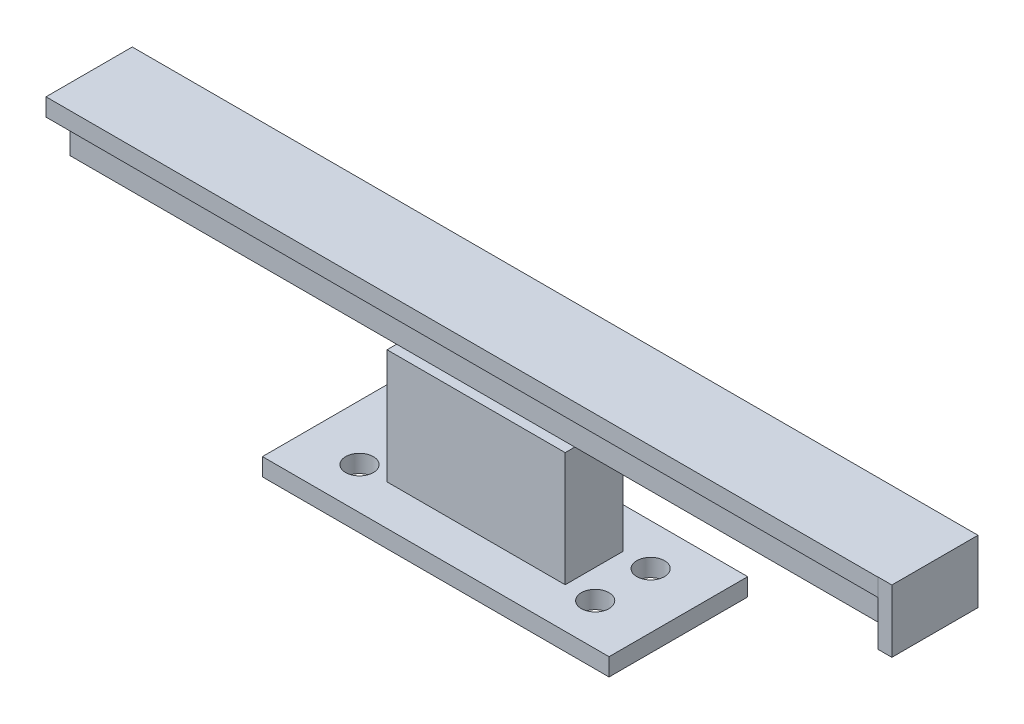
ISO-10303-21;
HEADER;
FILE_DESCRIPTION(('STEP AP214'),'2;1');
FILE_NAME('part.step','',(''),(''),'','','');
FILE_SCHEMA(('AUTOMOTIVE_DESIGN { 1 0 10303 214 1 1 1 1 }'));
ENDSEC;
DATA;
#1=APPLICATION_CONTEXT('core data for automotive mechanical design processes');
#2=APPLICATION_PROTOCOL_DEFINITION('international standard','automotive_design',2000,#1);
#3=PRODUCT_CONTEXT('',#1,'mechanical');
#4=PRODUCT('Part','Part','',(#3));
#5=PRODUCT_RELATED_PRODUCT_CATEGORY('part','',(#4));
#6=PRODUCT_DEFINITION_FORMATION('','',#4);
#7=PRODUCT_DEFINITION_CONTEXT('part definition',#1,'design');
#8=PRODUCT_DEFINITION('design','',#6,#7);
#9=PRODUCT_DEFINITION_SHAPE('','',#8);
#10=(LENGTH_UNIT() NAMED_UNIT(*) SI_UNIT(.MILLI.,.METRE.));
#11=(NAMED_UNIT(*) PLANE_ANGLE_UNIT() SI_UNIT($,.RADIAN.));
#12=(NAMED_UNIT(*) SI_UNIT($,.STERADIAN.) SOLID_ANGLE_UNIT());
#13=UNCERTAINTY_MEASURE_WITH_UNIT(LENGTH_MEASURE(1.E-05),#10,'distance_accuracy_value','');
#14=(GEOMETRIC_REPRESENTATION_CONTEXT(3) GLOBAL_UNCERTAINTY_ASSIGNED_CONTEXT((#13)) GLOBAL_UNIT_ASSIGNED_CONTEXT((#10,
#11,#12)) REPRESENTATION_CONTEXT('',''));
#15=CARTESIAN_POINT('',(0.,0.,0.));
#16=DIRECTION('',(0.,0.,1.));
#17=DIRECTION('',(1.,0.,0.));
#18=AXIS2_PLACEMENT_3D('',#15,#16,#17);
#19=CARTESIAN_POINT('',(59.9999999999999,25.56,5.29399999999999));
#20=DIRECTION('',(-1.,0.,0.));
#21=DIRECTION('',(0.,0.,1.));
#22=AXIS2_PLACEMENT_3D('',#19,#20,#21);
#23=PLANE('',#22);
#24=DIRECTION('',(0.,0.,-1.));
#25=VECTOR('',#24,1.);
#26=CARTESIAN_POINT('',(59.9999999999999,19.057726776808,-3.72300000000017));
#27=LINE('',#26,#25);
#28=CARTESIAN_POINT('',(59.9999999999999,19.057726776808,5.29399999999999));
#29=VERTEX_POINT('',#28);
#30=CARTESIAN_POINT('',(59.9999999999999,19.057726776808,-0.294000000000007));
#31=VERTEX_POINT('',#30);
#32=EDGE_CURVE('E11',#29,#31,#27,.T.);
#33=ORIENTED_EDGE('',*,*,#32,.F.);
#34=DIRECTION('',(0.,-1.,0.));
#35=VECTOR('',#34,1.);
#36=CARTESIAN_POINT('',(59.9999999999999,25.56,5.29399999999999));
#37=LINE('',#36,#35);
#38=CARTESIAN_POINT('',(59.9999999999999,19.05,5.29399999999999));
#39=VERTEX_POINT('',#38);
#40=EDGE_CURVE('E283',#29,#39,#37,.T.);
#41=ORIENTED_EDGE('',*,*,#40,.T.);
#42=DIRECTION('',(0.,0.,-1.));
#43=VECTOR('',#42,1.);
#44=CARTESIAN_POINT('',(59.9999999999999,19.05,5.29399999999999));
#45=LINE('',#44,#43);
#46=CARTESIAN_POINT('',(59.9999999999999,19.05,-0.294000000000007));
#47=VERTEX_POINT('',#46);
#48=EDGE_CURVE('E270',#39,#47,#45,.T.);
#49=ORIENTED_EDGE('',*,*,#48,.T.);
#50=DIRECTION('',(0.,-1.,0.));
#51=VECTOR('',#50,1.);
#52=CARTESIAN_POINT('',(59.9999999999999,25.56,-0.294000000000007));
#53=LINE('',#52,#51);
#54=EDGE_CURVE('E279',#31,#47,#53,.T.);
#55=ORIENTED_EDGE('',*,*,#54,.F.);
#56=EDGE_LOOP('',(#33,#41,#49,#55));
#57=FACE_BOUND('',#56,.T.);
#58=ADVANCED_FACE('F34',(#57),#23,.F.);
#59=DIRECTION('',(0.,-1.,0.));
#60=VECTOR('',#59,1.);
#61=CARTESIAN_POINT('',(59.9999999999999,28.1,8.70203818382956));
#62=LINE('',#61,#60);
#63=CARTESIAN_POINT('',(60.0000000000035,28.1,8.70203818382956));
#64=VERTEX_POINT('',#63);
#65=CARTESIAN_POINT('',(59.9999999999999,25.56,8.70203818382956));
#66=VERTEX_POINT('',#65);
#67=EDGE_CURVE('E59',#64,#66,#62,.T.);
#68=ORIENTED_EDGE('',*,*,#67,.F.);
#69=DIRECTION('',(0.,0.,-1.));
#70=VECTOR('',#69,1.);
#71=CARTESIAN_POINT('',(60.0000000000035,28.1,8.7229999999998));
#72=LINE('',#71,#70);
#73=CARTESIAN_POINT('',(60.0000000000035,28.1,8.7229999999998));
#74=VERTEX_POINT('',#73);
#75=EDGE_CURVE('E200',#74,#64,#72,.T.);
#76=ORIENTED_EDGE('',*,*,#75,.F.);
#77=DIRECTION('',(0.,-1.,0.));
#78=VECTOR('',#77,1.);
#79=CARTESIAN_POINT('',(60.0000000000035,28.1,8.7229999999998));
#80=LINE('',#79,#78);
#81=CARTESIAN_POINT('',(60.0000000000035,25.56,8.7229999999998));
#82=VERTEX_POINT('',#81);
#83=EDGE_CURVE('E249',#74,#82,#80,.T.);
#84=ORIENTED_EDGE('',*,*,#83,.T.);
#85=DIRECTION('',(0.,0.,-1.));
#86=VECTOR('',#85,1.);
#87=CARTESIAN_POINT('',(60.0000000000035,25.56,8.7229999999998));
#88=LINE('',#87,#86);
#89=EDGE_CURVE('E244',#82,#66,#88,.T.);
#90=ORIENTED_EDGE('',*,*,#89,.T.);
#91=EDGE_LOOP('',(#68,#76,#84,#90));
#92=FACE_BOUND('',#91,.T.);
#93=ADVANCED_FACE('F464',(#92),#23,.F.);
#94=CARTESIAN_POINT('',(0.,19.05,0.));
#95=DIRECTION('',(0.,1.,0.));
#96=DIRECTION('',(0.,0.,1.));
#97=AXIS2_PLACEMENT_3D('',#94,#95,#96);
#98=PLANE('',#97);
#99=DIRECTION('',(-1.,0.,0.));
#100=VECTOR('',#99,1.);
#101=CARTESIAN_POINT('',(59.9999999999999,19.05,-0.294000000000007));
#102=LINE('',#101,#100);
#103=CARTESIAN_POINT('',(12.848946131149,19.05,-0.293999999999999));
#104=VERTEX_POINT('',#103);
#105=CARTESIAN_POINT('',(-12.848946131149,19.05,-0.293999999999999));
#106=VERTEX_POINT('',#105);
#107=EDGE_CURVE('E43',#104,#106,#102,.T.);
#108=ORIENTED_EDGE('',*,*,#107,.F.);
#109=DIRECTION('',(0.,0.,-1.));
#110=VECTOR('',#109,1.);
#111=CARTESIAN_POINT('',(12.848946131149,19.05,6.67734795743635));
#112=LINE('',#111,#110);
#113=CARTESIAN_POINT('',(12.848946131149,19.05,-1.67734795743635));
#114=VERTEX_POINT('',#113);
#115=EDGE_CURVE('E298',#104,#114,#112,.T.);
#116=ORIENTED_EDGE('',*,*,#115,.T.);
#117=DIRECTION('',(-1.,0.,0.));
#118=VECTOR('',#117,1.);
#119=CARTESIAN_POINT('',(12.848946131149,19.05,-1.67734795743635));
#120=LINE('',#119,#118);
#121=CARTESIAN_POINT('',(-12.848946131149,19.05,-1.67734795743635));
#122=VERTEX_POINT('',#121);
#123=EDGE_CURVE('E301',#114,#122,#120,.T.);
#124=ORIENTED_EDGE('',*,*,#123,.T.);
#125=DIRECTION('',(0.,0.,1.));
#126=VECTOR('',#125,1.);
#127=CARTESIAN_POINT('',(-12.848946131149,19.05,6.67734795743635));
#128=LINE('',#127,#126);
#129=EDGE_CURVE('E291',#122,#106,#128,.T.);
#130=ORIENTED_EDGE('',*,*,#129,.T.);
#131=EDGE_LOOP('',(#108,#116,#124,#130));
#132=FACE_BOUND('',#131,.T.);
#133=ADVANCED_FACE('F449',(#132),#98,.T.);
#134=CARTESIAN_POINT('',(0.,2.54,0.));
#135=DIRECTION('',(0.,1.,0.));
#136=DIRECTION('',(0.,0.,1.));
#137=AXIS2_PLACEMENT_3D('',#134,#135,#136);
#138=PLANE('',#137);
#139=CARTESIAN_POINT('',(-17.,2.54,6.49999999999999));
#140=DIRECTION('',(0.,1.,0.));
#141=DIRECTION('',(0.,0.,1.));
#142=AXIS2_PLACEMENT_3D('',#139,#140,#141);
#143=CIRCLE('',#142,2.);
#144=CARTESIAN_POINT('',(-17.,2.54,8.49999999999999));
#145=VERTEX_POINT('',#144);
#146=EDGE_CURVE('E324',#145,#145,#143,.F.);
#147=ORIENTED_EDGE('',*,*,#146,.T.);
#148=EDGE_LOOP('',(#147));
#149=FACE_BOUND('',#148,.T.);
#150=CARTESIAN_POINT('',(17.,2.54,-1.5));
#151=DIRECTION('',(0.,1.,0.));
#152=DIRECTION('',(0.,0.,1.));
#153=AXIS2_PLACEMENT_3D('',#150,#151,#152);
#154=CIRCLE('',#153,2.);
#155=CARTESIAN_POINT('',(17.,2.54,0.499999999999995));
#156=VERTEX_POINT('',#155);
#157=EDGE_CURVE('E327',#156,#156,#154,.T.);
#158=ORIENTED_EDGE('',*,*,#157,.F.);
#159=EDGE_LOOP('',(#158));
#160=FACE_BOUND('',#159,.T.);
#161=CARTESIAN_POINT('',(17.,2.54,6.5));
#162=DIRECTION('',(0.,1.,0.));
#163=DIRECTION('',(0.,0.,1.));
#164=AXIS2_PLACEMENT_3D('',#161,#162,#163);
#165=CIRCLE('',#164,2.);
#166=CARTESIAN_POINT('',(17.,2.54,8.49999999999999));
#167=VERTEX_POINT('',#166);
#168=EDGE_CURVE('E331',#167,#167,#165,.T.);
#169=ORIENTED_EDGE('',*,*,#168,.F.);
#170=EDGE_LOOP('',(#169));
#171=FACE_BOUND('',#170,.T.);
#172=DIRECTION('',(0.,0.,-1.));
#173=VECTOR('',#172,1.);
#174=CARTESIAN_POINT('',(-25.,2.54,0.));
#175=LINE('',#174,#173);
#176=CARTESIAN_POINT('',(-25.,2.54,12.5));
#177=VERTEX_POINT('',#176);
#178=CARTESIAN_POINT('',(-25.,2.54,-7.5));
#179=VERTEX_POINT('',#178);
#180=EDGE_CURVE('E334',#177,#179,#175,.T.);
#181=ORIENTED_EDGE('',*,*,#180,.F.);
#182=DIRECTION('',(-1.,0.,0.));
#183=VECTOR('',#182,1.);
#184=CARTESIAN_POINT('',(0.,2.54,12.5));
#185=LINE('',#184,#183);
#186=CARTESIAN_POINT('',(25.,2.54,12.5));
#187=VERTEX_POINT('',#186);
#188=EDGE_CURVE('E337',#187,#177,#185,.T.);
#189=ORIENTED_EDGE('',*,*,#188,.F.);
#190=DIRECTION('',(0.,0.,-1.));
#191=VECTOR('',#190,1.);
#192=CARTESIAN_POINT('',(25.,2.54,0.));
#193=LINE('',#192,#191);
#194=CARTESIAN_POINT('',(25.,2.54,-7.50000000000001));
#195=VERTEX_POINT('',#194);
#196=EDGE_CURVE('E340',#187,#195,#193,.T.);
#197=ORIENTED_EDGE('',*,*,#196,.T.);
#198=DIRECTION('',(-1.,0.,0.));
#199=VECTOR('',#198,1.);
#200=CARTESIAN_POINT('',(0.,2.54,-7.5));
#201=LINE('',#200,#199);
#202=EDGE_CURVE('E343',#195,#179,#201,.T.);
#203=ORIENTED_EDGE('',*,*,#202,.T.);
#204=EDGE_LOOP('',(#181,#189,#197,#203));
#205=FACE_BOUND('',#204,.T.);
#206=CARTESIAN_POINT('',(-17.,2.54,-1.5));
#207=DIRECTION('',(0.,1.,0.));
#208=DIRECTION('',(0.,0.,1.));
#209=AXIS2_PLACEMENT_3D('',#206,#207,#208);
#210=CIRCLE('',#209,2.);
#211=CARTESIAN_POINT('',(-17.,2.54,0.499999999999997));
#212=VERTEX_POINT('',#211);
#213=EDGE_CURVE('E345',#212,#212,#210,.F.);
#214=ORIENTED_EDGE('',*,*,#213,.T.);
#215=EDGE_LOOP('',(#214));
#216=FACE_BOUND('',#215,.T.);
#217=DIRECTION('',(1.,0.,0.));
#218=VECTOR('',#217,1.);
#219=CARTESIAN_POINT('',(12.848946131149,2.54,6.67734795743635));
#220=LINE('',#219,#218);
#221=CARTESIAN_POINT('',(-12.848946131149,2.54,6.67734795743635));
#222=VERTEX_POINT('',#221);
#223=CARTESIAN_POINT('',(12.848946131149,2.54,6.67734795743635));
#224=VERTEX_POINT('',#223);
#225=EDGE_CURVE('E307',#222,#224,#220,.T.);
#226=ORIENTED_EDGE('',*,*,#225,.F.);
#227=DIRECTION('',(0.,0.,1.));
#228=VECTOR('',#227,1.);
#229=CARTESIAN_POINT('',(-12.848946131149,2.54,6.67734795743635));
#230=LINE('',#229,#228);
#231=CARTESIAN_POINT('',(-12.848946131149,2.54,-1.67734795743635));
#232=VERTEX_POINT('',#231);
#233=EDGE_CURVE('E290',#232,#222,#230,.T.);
#234=ORIENTED_EDGE('',*,*,#233,.F.);
#235=DIRECTION('',(-1.,0.,0.));
#236=VECTOR('',#235,1.);
#237=CARTESIAN_POINT('',(12.848946131149,2.54,-1.67734795743635));
#238=LINE('',#237,#236);
#239=CARTESIAN_POINT('',(12.848946131149,2.54,-1.67734795743635));
#240=VERTEX_POINT('',#239);
#241=EDGE_CURVE('E312',#240,#232,#238,.T.);
#242=ORIENTED_EDGE('',*,*,#241,.F.);
#243=DIRECTION('',(0.,0.,-1.));
#244=VECTOR('',#243,1.);
#245=CARTESIAN_POINT('',(12.848946131149,2.54,6.67734795743635));
#246=LINE('',#245,#244);
#247=EDGE_CURVE('E309',#224,#240,#246,.T.);
#248=ORIENTED_EDGE('',*,*,#247,.F.);
#249=EDGE_LOOP('',(#226,#234,#242,#248));
#250=FACE_BOUND('',#249,.T.);
#251=ADVANCED_FACE('F442',(#149,#160,#171,#205,#216,#250),#138,.T.);
#252=CARTESIAN_POINT('',(-25.,2.54,0.));
#253=DIRECTION('',(-1.,0.,0.));
#254=DIRECTION('',(0.,0.,1.));
#255=AXIS2_PLACEMENT_3D('',#252,#253,#254);
#256=PLANE('',#255);
#257=DIRECTION('',(0.,0.,-1.));
#258=VECTOR('',#257,1.);
#259=CARTESIAN_POINT('',(-25.,0.,0.));
#260=LINE('',#259,#258);
#261=CARTESIAN_POINT('',(-25.,0.,12.5));
#262=VERTEX_POINT('',#261);
#263=CARTESIAN_POINT('',(-25.,0.,-7.5));
#264=VERTEX_POINT('',#263);
#265=EDGE_CURVE('E357',#262,#264,#260,.T.);
#266=ORIENTED_EDGE('',*,*,#265,.F.);
#267=DIRECTION('',(0.,-1.,0.));
#268=VECTOR('',#267,1.);
#269=CARTESIAN_POINT('',(-25.,2.54,12.5));
#270=LINE('',#269,#268);
#271=EDGE_CURVE('E38',#177,#262,#270,.T.);
#272=ORIENTED_EDGE('',*,*,#271,.F.);
#273=ORIENTED_EDGE('',*,*,#180,.T.);
#274=DIRECTION('',(0.,-1.,0.));
#275=VECTOR('',#274,1.);
#276=CARTESIAN_POINT('',(-25.,2.54,-7.5));
#277=LINE('',#276,#275);
#278=EDGE_CURVE('E348',#179,#264,#277,.T.);
#279=ORIENTED_EDGE('',*,*,#278,.T.);
#280=EDGE_LOOP('',(#266,#272,#273,#279));
#281=FACE_BOUND('',#280,.T.);
#282=ADVANCED_FACE('F653',(#281),#256,.T.);
#283=CARTESIAN_POINT('',(0.,2.54,12.5));
#284=DIRECTION('',(0.,0.,1.));
#285=DIRECTION('',(1.,0.,0.));
#286=AXIS2_PLACEMENT_3D('',#283,#284,#285);
#287=PLANE('',#286);
#288=DIRECTION('',(-1.,0.,0.));
#289=VECTOR('',#288,1.);
#290=CARTESIAN_POINT('',(0.,0.,12.5));
#291=LINE('',#290,#289);
#292=CARTESIAN_POINT('',(25.,0.,12.5));
#293=VERTEX_POINT('',#292);
#294=EDGE_CURVE('E360',#293,#262,#291,.T.);
#295=ORIENTED_EDGE('',*,*,#294,.F.);
#296=DIRECTION('',(0.,-1.,0.));
#297=VECTOR('',#296,1.);
#298=CARTESIAN_POINT('',(25.,2.54,12.5));
#299=LINE('',#298,#297);
#300=EDGE_CURVE('E374',#187,#293,#299,.T.);
#301=ORIENTED_EDGE('',*,*,#300,.F.);
#302=ORIENTED_EDGE('',*,*,#188,.T.);
#303=ORIENTED_EDGE('',*,*,#271,.T.);
#304=EDGE_LOOP('',(#295,#301,#302,#303));
#305=FACE_BOUND('',#304,.T.);
#306=ADVANCED_FACE('F719',(#305),#287,.T.);
#307=CARTESIAN_POINT('',(25.,2.54,0.));
#308=DIRECTION('',(-1.,0.,0.));
#309=DIRECTION('',(0.,0.,1.));
#310=AXIS2_PLACEMENT_3D('',#307,#308,#309);
#311=PLANE('',#310);
#312=DIRECTION('',(0.,0.,-1.));
#313=VECTOR('',#312,1.);
#314=CARTESIAN_POINT('',(25.,0.,0.));
#315=LINE('',#314,#313);
#316=CARTESIAN_POINT('',(25.,0.,-7.50000000000001));
#317=VERTEX_POINT('',#316);
#318=EDGE_CURVE('E363',#293,#317,#315,.T.);
#319=ORIENTED_EDGE('',*,*,#318,.T.);
#320=DIRECTION('',(0.,-1.,0.));
#321=VECTOR('',#320,1.);
#322=CARTESIAN_POINT('',(25.,2.54,-7.50000000000001));
#323=LINE('',#322,#321);
#324=EDGE_CURVE('E372',#195,#317,#323,.T.);
#325=ORIENTED_EDGE('',*,*,#324,.F.);
#326=ORIENTED_EDGE('',*,*,#196,.F.);
#327=ORIENTED_EDGE('',*,*,#300,.T.);
#328=EDGE_LOOP('',(#319,#325,#326,#327));
#329=FACE_BOUND('',#328,.T.);
#330=ADVANCED_FACE('F709',(#329),#311,.F.);
#331=CARTESIAN_POINT('',(0.,2.54,-7.5));
#332=DIRECTION('',(0.,0.,1.));
#333=DIRECTION('',(1.,0.,0.));
#334=AXIS2_PLACEMENT_3D('',#331,#332,#333);
#335=PLANE('',#334);
#336=DIRECTION('',(-1.,0.,0.));
#337=VECTOR('',#336,1.);
#338=CARTESIAN_POINT('',(0.,0.,-7.5));
#339=LINE('',#338,#337);
#340=EDGE_CURVE('E366',#317,#264,#339,.T.);
#341=ORIENTED_EDGE('',*,*,#340,.T.);
#342=ORIENTED_EDGE('',*,*,#278,.F.);
#343=ORIENTED_EDGE('',*,*,#202,.F.);
#344=ORIENTED_EDGE('',*,*,#324,.T.);
#345=EDGE_LOOP('',(#341,#342,#343,#344));
#346=FACE_BOUND('',#345,.T.);
#347=ADVANCED_FACE('F699',(#346),#335,.F.);
#348=CARTESIAN_POINT('',(17.,2.54,6.5));
#349=DIRECTION('',(0.,-1.,0.));
#350=DIRECTION('',(0.,0.,-1.));
#351=AXIS2_PLACEMENT_3D('',#348,#349,#350);
#352=CYLINDRICAL_SURFACE('',#351,2.);
#353=ORIENTED_EDGE('',*,*,#168,.T.);
#354=EDGE_LOOP('',(#353));
#355=FACE_BOUND('',#354,.T.);
#356=CARTESIAN_POINT('',(17.,0.,6.5));
#357=DIRECTION('',(0.,1.,0.));
#358=DIRECTION('',(0.,0.,1.));
#359=AXIS2_PLACEMENT_3D('',#356,#357,#358);
#360=CIRCLE('',#359,2.);
#361=CARTESIAN_POINT('',(17.,0.,8.49999999999999));
#362=VERTEX_POINT('',#361);
#363=EDGE_CURVE('E354',#362,#362,#360,.T.);
#364=ORIENTED_EDGE('',*,*,#363,.F.);
#365=EDGE_LOOP('',(#364));
#366=FACE_BOUND('',#365,.T.);
#367=ADVANCED_FACE('F690',(#355,#366),#352,.F.);
#368=CARTESIAN_POINT('',(17.,2.54,-1.5));
#369=DIRECTION('',(0.,-1.,0.));
#370=DIRECTION('',(0.,0.,-1.));
#371=AXIS2_PLACEMENT_3D('',#368,#369,#370);
#372=CYLINDRICAL_SURFACE('',#371,2.);
#373=ORIENTED_EDGE('',*,*,#157,.T.);
#374=EDGE_LOOP('',(#373));
#375=FACE_BOUND('',#374,.T.);
#376=CARTESIAN_POINT('',(17.,0.,-1.5));
#377=DIRECTION('',(0.,1.,0.));
#378=DIRECTION('',(0.,0.,1.));
#379=AXIS2_PLACEMENT_3D('',#376,#377,#378);
#380=CIRCLE('',#379,2.);
#381=CARTESIAN_POINT('',(17.,0.,0.499999999999995));
#382=VERTEX_POINT('',#381);
#383=EDGE_CURVE('E351',#382,#382,#380,.T.);
#384=ORIENTED_EDGE('',*,*,#383,.F.);
#385=EDGE_LOOP('',(#384));
#386=FACE_BOUND('',#385,.T.);
#387=ADVANCED_FACE('F681',(#375,#386),#372,.F.);
#388=CARTESIAN_POINT('',(-17.,2.54,6.49999999999999));
#389=DIRECTION('',(0.,-1.,0.));
#390=DIRECTION('',(0.,0.,-1.));
#391=AXIS2_PLACEMENT_3D('',#388,#389,#390);
#392=CYLINDRICAL_SURFACE('',#391,2.);
#393=ORIENTED_EDGE('',*,*,#146,.F.);
#394=EDGE_LOOP('',(#393));
#395=FACE_BOUND('',#394,.T.);
#396=CARTESIAN_POINT('',(-17.,0.,6.49999999999999));
#397=DIRECTION('',(0.,1.,0.));
#398=DIRECTION('',(0.,0.,1.));
#399=AXIS2_PLACEMENT_3D('',#396,#397,#398);
#400=CIRCLE('',#399,2.);
#401=CARTESIAN_POINT('',(-17.,0.,8.49999999999999));
#402=VERTEX_POINT('',#401);
#403=EDGE_CURVE('E323',#402,#402,#400,.F.);
#404=ORIENTED_EDGE('',*,*,#403,.T.);
#405=EDGE_LOOP('',(#404));
#406=FACE_BOUND('',#405,.T.);
#407=ADVANCED_FACE('F36',(#395,#406),#392,.F.);
#408=CARTESIAN_POINT('',(-17.,2.54,-1.5));
#409=DIRECTION('',(0.,-1.,0.));
#410=DIRECTION('',(0.,0.,-1.));
#411=AXIS2_PLACEMENT_3D('',#408,#409,#410);
#412=CYLINDRICAL_SURFACE('',#411,2.);
#413=ORIENTED_EDGE('',*,*,#213,.F.);
#414=EDGE_LOOP('',(#413));
#415=FACE_BOUND('',#414,.T.);
#416=CARTESIAN_POINT('',(-17.,0.,-1.5));
#417=DIRECTION('',(0.,1.,0.));
#418=DIRECTION('',(0.,0.,1.));
#419=AXIS2_PLACEMENT_3D('',#416,#417,#418);
#420=CIRCLE('',#419,2.);
#421=CARTESIAN_POINT('',(-17.,0.,0.499999999999997));
#422=VERTEX_POINT('',#421);
#423=EDGE_CURVE('E328',#422,#422,#420,.F.);
#424=ORIENTED_EDGE('',*,*,#423,.T.);
#425=EDGE_LOOP('',(#424));
#426=FACE_BOUND('',#425,.T.);
#427=ADVANCED_FACE('F662',(#415,#426),#412,.F.);
#428=CARTESIAN_POINT('',(0.,0.,0.));
#429=DIRECTION('',(0.,1.,0.));
#430=DIRECTION('',(0.,0.,1.));
#431=AXIS2_PLACEMENT_3D('',#428,#429,#430);
#432=PLANE('',#431);
#433=ORIENTED_EDGE('',*,*,#403,.F.);
#434=EDGE_LOOP('',(#433));
#435=FACE_BOUND('',#434,.T.);
#436=ORIENTED_EDGE('',*,*,#383,.T.);
#437=EDGE_LOOP('',(#436));
#438=FACE_BOUND('',#437,.T.);
#439=ORIENTED_EDGE('',*,*,#363,.T.);
#440=EDGE_LOOP('',(#439));
#441=FACE_BOUND('',#440,.T.);
#442=ORIENTED_EDGE('',*,*,#265,.T.);
#443=ORIENTED_EDGE('',*,*,#340,.F.);
#444=ORIENTED_EDGE('',*,*,#318,.F.);
#445=ORIENTED_EDGE('',*,*,#294,.T.);
#446=EDGE_LOOP('',(#442,#443,#444,#445));
#447=FACE_BOUND('',#446,.T.);
#448=ORIENTED_EDGE('',*,*,#423,.F.);
#449=EDGE_LOOP('',(#448));
#450=FACE_BOUND('',#449,.T.);
#451=ADVANCED_FACE('F630',(#435,#438,#441,#447,#450),#432,.F.);
#452=CARTESIAN_POINT('',(-12.848946131149,19.05,6.67734795743635));
#453=DIRECTION('',(1.,0.,0.));
#454=DIRECTION('',(0.,0.,-1.));
#455=AXIS2_PLACEMENT_3D('',#452,#453,#454);
#456=PLANE('',#455);
#457=ORIENTED_EDGE('',*,*,#233,.T.);
#458=DIRECTION('',(0.,-1.,0.));
#459=VECTOR('',#458,1.);
#460=CARTESIAN_POINT('',(-12.848946131149,19.05,6.67734795743635));
#461=LINE('',#460,#459);
#462=CARTESIAN_POINT('',(-12.848946131149,19.05,6.67734795743635));
#463=VERTEX_POINT('',#462);
#464=EDGE_CURVE('E321',#463,#222,#461,.T.);
#465=ORIENTED_EDGE('',*,*,#464,.F.);
#466=CARTESIAN_POINT('',(-12.848946131149,19.05,5.294));
#467=VERTEX_POINT('',#466);
#468=EDGE_CURVE('E296',#467,#463,#128,.T.);
#469=ORIENTED_EDGE('',*,*,#468,.F.);
#470=EDGE_CURVE('E295',#106,#467,#128,.T.);
#471=ORIENTED_EDGE('',*,*,#470,.F.);
#472=ORIENTED_EDGE('',*,*,#129,.F.);
#473=DIRECTION('',(0.,-1.,0.));
#474=VECTOR('',#473,1.);
#475=CARTESIAN_POINT('',(-12.848946131149,19.05,-1.67734795743635));
#476=LINE('',#475,#474);
#477=EDGE_CURVE('E304',#122,#232,#476,.T.);
#478=ORIENTED_EDGE('',*,*,#477,.T.);
#479=EDGE_LOOP('',(#457,#465,#469,#471,#472,#478));
#480=FACE_BOUND('',#479,.T.);
#481=ADVANCED_FACE('F435',(#480),#456,.F.);
#482=CARTESIAN_POINT('',(12.848946131149,19.05,6.67734795743635));
#483=DIRECTION('',(0.,0.,-1.));
#484=DIRECTION('',(-1.,0.,0.));
#485=AXIS2_PLACEMENT_3D('',#482,#483,#484);
#486=PLANE('',#485);
#487=ORIENTED_EDGE('',*,*,#225,.T.);
#488=DIRECTION('',(0.,-1.,0.));
#489=VECTOR('',#488,1.);
#490=CARTESIAN_POINT('',(12.848946131149,19.05,6.67734795743635));
#491=LINE('',#490,#489);
#492=CARTESIAN_POINT('',(12.848946131149,19.05,6.67734795743635));
#493=VERTEX_POINT('',#492);
#494=EDGE_CURVE('E318',#493,#224,#491,.T.);
#495=ORIENTED_EDGE('',*,*,#494,.F.);
#496=DIRECTION('',(1.,0.,0.));
#497=VECTOR('',#496,1.);
#498=CARTESIAN_POINT('',(12.848946131149,19.05,6.67734795743635));
#499=LINE('',#498,#497);
#500=EDGE_CURVE('E294',#463,#493,#499,.T.);
#501=ORIENTED_EDGE('',*,*,#500,.F.);
#502=ORIENTED_EDGE('',*,*,#464,.T.);
#503=EDGE_LOOP('',(#487,#495,#501,#502));
#504=FACE_BOUND('',#503,.T.);
#505=ADVANCED_FACE('F433',(#504),#486,.F.);
#506=CARTESIAN_POINT('',(12.848946131149,19.05,6.67734795743635));
#507=DIRECTION('',(-1.,0.,0.));
#508=DIRECTION('',(0.,0.,1.));
#509=AXIS2_PLACEMENT_3D('',#506,#507,#508);
#510=PLANE('',#509);
#511=ORIENTED_EDGE('',*,*,#247,.T.);
#512=DIRECTION('',(0.,-1.,0.));
#513=VECTOR('',#512,1.);
#514=CARTESIAN_POINT('',(12.848946131149,19.05,-1.67734795743635));
#515=LINE('',#514,#513);
#516=EDGE_CURVE('E316',#114,#240,#515,.T.);
#517=ORIENTED_EDGE('',*,*,#516,.F.);
#518=ORIENTED_EDGE('',*,*,#115,.F.);
#519=CARTESIAN_POINT('',(12.848946131149,19.05,5.294));
#520=VERTEX_POINT('',#519);
#521=EDGE_CURVE('E302',#520,#104,#112,.T.);
#522=ORIENTED_EDGE('',*,*,#521,.F.);
#523=EDGE_CURVE('E299',#493,#520,#112,.T.);
#524=ORIENTED_EDGE('',*,*,#523,.F.);
#525=ORIENTED_EDGE('',*,*,#494,.T.);
#526=EDGE_LOOP('',(#511,#517,#518,#522,#524,#525));
#527=FACE_BOUND('',#526,.T.);
#528=ADVANCED_FACE('F444',(#527),#510,.F.);
#529=CARTESIAN_POINT('',(12.848946131149,19.05,-1.67734795743635));
#530=DIRECTION('',(0.,0.,1.));
#531=DIRECTION('',(1.,0.,0.));
#532=AXIS2_PLACEMENT_3D('',#529,#530,#531);
#533=PLANE('',#532);
#534=ORIENTED_EDGE('',*,*,#241,.T.);
#535=ORIENTED_EDGE('',*,*,#477,.F.);
#536=ORIENTED_EDGE('',*,*,#123,.F.);
#537=ORIENTED_EDGE('',*,*,#516,.T.);
#538=EDGE_LOOP('',(#534,#535,#536,#537));
#539=FACE_BOUND('',#538,.T.);
#540=ADVANCED_FACE('F452',(#539),#533,.F.);
#541=DIRECTION('',(1.,0.,0.));
#542=VECTOR('',#541,1.);
#543=CARTESIAN_POINT('',(59.9999999999999,19.05,5.29399999999999));
#544=LINE('',#543,#542);
#545=EDGE_CURVE('E271',#467,#520,#544,.T.);
#546=ORIENTED_EDGE('',*,*,#545,.F.);
#547=ORIENTED_EDGE('',*,*,#468,.T.);
#548=ORIENTED_EDGE('',*,*,#500,.T.);
#549=ORIENTED_EDGE('',*,*,#523,.T.);
#550=EDGE_LOOP('',(#546,#547,#548,#549));
#551=FACE_BOUND('',#550,.T.);
#552=ADVANCED_FACE('F429',(#551),#98,.T.);
#553=CARTESIAN_POINT('',(0.,19.05,0.));
#554=DIRECTION('',(0.,1.,0.));
#555=DIRECTION('',(0.,0.,1.));
#556=AXIS2_PLACEMENT_3D('',#553,#554,#555);
#557=PLANE('',#556);
#558=CARTESIAN_POINT('',(-60.0000000000001,19.05,-0.293999999999992));
#559=VERTEX_POINT('',#558);
#560=EDGE_CURVE('E274',#106,#559,#102,.T.);
#561=ORIENTED_EDGE('',*,*,#560,.F.);
#562=ORIENTED_EDGE('',*,*,#470,.T.);
#563=CARTESIAN_POINT('',(-60.0000000000001,19.05,5.29400000000001));
#564=VERTEX_POINT('',#563);
#565=EDGE_CURVE('E267',#564,#467,#544,.T.);
#566=ORIENTED_EDGE('',*,*,#565,.F.);
#567=DIRECTION('',(0.,0.,1.));
#568=VECTOR('',#567,1.);
#569=CARTESIAN_POINT('',(-60.0000000000001,19.05,5.29400000000001));
#570=LINE('',#569,#568);
#571=EDGE_CURVE('E255',#559,#564,#570,.T.);
#572=ORIENTED_EDGE('',*,*,#571,.F.);
#573=EDGE_LOOP('',(#561,#562,#566,#572));
#574=FACE_BOUND('',#573,.T.);
#575=ADVANCED_FACE('F423',(#574),#557,.F.);
#576=EDGE_CURVE('E266',#520,#39,#544,.T.);
#577=ORIENTED_EDGE('',*,*,#576,.F.);
#578=ORIENTED_EDGE('',*,*,#521,.T.);
#579=EDGE_CURVE('E260',#47,#104,#102,.T.);
#580=ORIENTED_EDGE('',*,*,#579,.F.);
#581=ORIENTED_EDGE('',*,*,#48,.F.);
#582=EDGE_LOOP('',(#577,#578,#580,#581));
#583=FACE_BOUND('',#582,.T.);
#584=ADVANCED_FACE('F391',(#583),#557,.F.);
#585=CARTESIAN_POINT('',(-60.0000000000001,25.56,5.29400000000001));
#586=DIRECTION('',(1.,0.,0.));
#587=DIRECTION('',(0.,0.,-1.));
#588=AXIS2_PLACEMENT_3D('',#585,#586,#587);
#589=PLANE('',#588);
#590=ORIENTED_EDGE('',*,*,#571,.T.);
#591=DIRECTION('',(0.,-1.,0.));
#592=VECTOR('',#591,1.);
#593=CARTESIAN_POINT('',(-60.0000000000001,25.56,5.29400000000001));
#594=LINE('',#593,#592);
#595=CARTESIAN_POINT('',(-60.0000000000001,25.56,5.29400000000001));
#596=VERTEX_POINT('',#595);
#597=EDGE_CURVE('E287',#596,#564,#594,.T.);
#598=ORIENTED_EDGE('',*,*,#597,.F.);
#599=DIRECTION('',(0.,0.,1.));
#600=VECTOR('',#599,1.);
#601=CARTESIAN_POINT('',(-59.9999999999965,25.56,8.72299999999981));
#602=LINE('',#601,#600);
#603=CARTESIAN_POINT('',(-59.9999999999965,25.56,8.72299999999981));
#604=VERTEX_POINT('',#603);
#605=EDGE_CURVE('E231',#596,#604,#602,.T.);
#606=ORIENTED_EDGE('',*,*,#605,.T.);
#607=DIRECTION('',(0.,-1.,0.));
#608=VECTOR('',#607,1.);
#609=CARTESIAN_POINT('',(-59.9999999999965,28.1,8.72299999999981));
#610=LINE('',#609,#608);
#611=CARTESIAN_POINT('',(-59.9999999999965,28.1,8.72299999999981));
#612=VERTEX_POINT('',#611);
#613=EDGE_CURVE('E252',#612,#604,#610,.T.);
#614=ORIENTED_EDGE('',*,*,#613,.F.);
#615=DIRECTION('',(0.,0.,1.));
#616=VECTOR('',#615,1.);
#617=CARTESIAN_POINT('',(-59.9999999999965,28.1,8.72299999999981));
#618=LINE('',#617,#616);
#619=CARTESIAN_POINT('',(-59.9999999999965,28.1,-3.72300000000018));
#620=VERTEX_POINT('',#619);
#621=EDGE_CURVE('E232',#620,#612,#618,.T.);
#622=ORIENTED_EDGE('',*,*,#621,.F.);
#623=DIRECTION('',(0.,-1.,0.));
#624=VECTOR('',#623,1.);
#625=CARTESIAN_POINT('',(-59.9999999999965,28.1,-3.72300000000018));
#626=LINE('',#625,#624);
#627=CARTESIAN_POINT('',(-59.9999999999965,25.56,-3.72300000000018));
#628=VERTEX_POINT('',#627);
#629=EDGE_CURVE('E196',#620,#628,#626,.T.);
#630=ORIENTED_EDGE('',*,*,#629,.T.);
#631=CARTESIAN_POINT('',(-59.9999999999965,25.56,-0.293999999999999));
#632=VERTEX_POINT('',#631);
#633=EDGE_CURVE('E238',#628,#632,#602,.T.);
#634=ORIENTED_EDGE('',*,*,#633,.T.);
#635=DIRECTION('',(0.,-1.,0.));
#636=VECTOR('',#635,1.);
#637=CARTESIAN_POINT('',(-60.0000000000001,25.56,-0.293999999999992));
#638=LINE('',#637,#636);
#639=EDGE_CURVE('E263',#632,#559,#638,.T.);
#640=ORIENTED_EDGE('',*,*,#639,.T.);
#641=EDGE_LOOP('',(#590,#598,#606,#614,#622,#630,#634,#640));
#642=FACE_BOUND('',#641,.T.);
#643=ADVANCED_FACE('F418',(#642),#589,.F.);
#644=CARTESIAN_POINT('',(59.9999999999999,25.56,5.29399999999999));
#645=DIRECTION('',(0.,0.,-1.));
#646=DIRECTION('',(-1.,0.,0.));
#647=AXIS2_PLACEMENT_3D('',#644,#645,#646);
#648=PLANE('',#647);
#649=ORIENTED_EDGE('',*,*,#565,.T.);
#650=ORIENTED_EDGE('',*,*,#545,.T.);
#651=ORIENTED_EDGE('',*,*,#576,.T.);
#652=ORIENTED_EDGE('',*,*,#40,.F.);
#653=CARTESIAN_POINT('',(59.9999999999999,25.56,5.29399999999999));
#654=VERTEX_POINT('',#653);
#655=EDGE_CURVE('E284',#654,#29,#37,.T.);
#656=ORIENTED_EDGE('',*,*,#655,.F.);
#657=DIRECTION('',(1.,0.,0.));
#658=VECTOR('',#657,1.);
#659=CARTESIAN_POINT('',(59.9999999999999,25.56,5.29399999999999));
#660=LINE('',#659,#658);
#661=EDGE_CURVE('E256',#596,#654,#660,.T.);
#662=ORIENTED_EDGE('',*,*,#661,.F.);
#663=ORIENTED_EDGE('',*,*,#597,.T.);
#664=EDGE_LOOP('',(#649,#650,#651,#652,#656,#662,#663));
#665=FACE_BOUND('',#664,.T.);
#666=ADVANCED_FACE('F387',(#665),#648,.F.);
#667=CARTESIAN_POINT('',(59.9999999999999,25.56,-0.294000000000007));
#668=DIRECTION('',(0.,0.,1.));
#669=DIRECTION('',(1.,0.,0.));
#670=AXIS2_PLACEMENT_3D('',#667,#668,#669);
#671=PLANE('',#670);
#672=ORIENTED_EDGE('',*,*,#579,.T.);
#673=ORIENTED_EDGE('',*,*,#107,.T.);
#674=ORIENTED_EDGE('',*,*,#560,.T.);
#675=ORIENTED_EDGE('',*,*,#639,.F.);
#676=DIRECTION('',(-1.,0.,0.));
#677=VECTOR('',#676,1.);
#678=CARTESIAN_POINT('',(59.9999999999999,25.56,-0.294000000000007));
#679=LINE('',#678,#677);
#680=CARTESIAN_POINT('',(59.9999999999999,25.56,-0.294000000000007));
#681=VERTEX_POINT('',#680);
#682=EDGE_CURVE('E259',#681,#632,#679,.T.);
#683=ORIENTED_EDGE('',*,*,#682,.F.);
#684=EDGE_CURVE('E280',#681,#31,#53,.T.);
#685=ORIENTED_EDGE('',*,*,#684,.T.);
#686=ORIENTED_EDGE('',*,*,#54,.T.);
#687=EDGE_LOOP('',(#672,#673,#674,#675,#683,#685,#686));
#688=FACE_BOUND('',#687,.T.);
#689=ADVANCED_FACE('F395',(#688),#671,.F.);
#690=CARTESIAN_POINT('',(0.,25.56,0.));
#691=DIRECTION('',(0.,1.,0.));
#692=DIRECTION('',(0.,0.,1.));
#693=AXIS2_PLACEMENT_3D('',#690,#691,#692);
#694=PLANE('',#693);
#695=ORIENTED_EDGE('',*,*,#605,.F.);
#696=ORIENTED_EDGE('',*,*,#661,.T.);
#697=EDGE_CURVE('E246',#66,#654,#88,.T.);
#698=ORIENTED_EDGE('',*,*,#697,.F.);
#699=ORIENTED_EDGE('',*,*,#89,.F.);
#700=DIRECTION('',(1.,0.,0.));
#701=VECTOR('',#700,1.);
#702=CARTESIAN_POINT('',(60.0000000000035,25.56,8.7229999999998));
#703=LINE('',#702,#701);
#704=EDGE_CURVE('E241',#604,#82,#703,.T.);
#705=ORIENTED_EDGE('',*,*,#704,.F.);
#706=EDGE_LOOP('',(#695,#696,#698,#699,#705));
#707=FACE_BOUND('',#706,.T.);
#708=ADVANCED_FACE('F413',(#707),#694,.F.);
#709=CARTESIAN_POINT('',(60.0000000000035,25.56,-3.72300000000017));
#710=VERTEX_POINT('',#709);
#711=EDGE_CURVE('E243',#681,#710,#88,.T.);
#712=ORIENTED_EDGE('',*,*,#711,.F.);
#713=ORIENTED_EDGE('',*,*,#682,.T.);
#714=ORIENTED_EDGE('',*,*,#633,.F.);
#715=DIRECTION('',(-1.,0.,0.));
#716=VECTOR('',#715,1.);
#717=CARTESIAN_POINT('',(60.0000000000035,25.56,-3.72300000000017));
#718=LINE('',#717,#716);
#719=EDGE_CURVE('E235',#710,#628,#718,.T.);
#720=ORIENTED_EDGE('',*,*,#719,.F.);
#721=EDGE_LOOP('',(#712,#713,#714,#720));
#722=FACE_BOUND('',#721,.T.);
#723=ADVANCED_FACE('F486',(#722),#694,.F.);
#724=CARTESIAN_POINT('',(60.0000000000035,28.1,8.7229999999998));
#725=DIRECTION('',(0.,0.,-1.));
#726=DIRECTION('',(-1.,0.,0.));
#727=AXIS2_PLACEMENT_3D('',#724,#725,#726);
#728=PLANE('',#727);
#729=ORIENTED_EDGE('',*,*,#704,.T.);
#730=ORIENTED_EDGE('',*,*,#83,.F.);
#731=DIRECTION('',(1.,0.,0.));
#732=VECTOR('',#731,1.);
#733=CARTESIAN_POINT('',(60.0000000000035,28.1,8.7229999999998));
#734=LINE('',#733,#732);
#735=EDGE_CURVE('E234',#612,#74,#734,.T.);
#736=ORIENTED_EDGE('',*,*,#735,.F.);
#737=ORIENTED_EDGE('',*,*,#613,.T.);
#738=EDGE_LOOP('',(#729,#730,#736,#737));
#739=FACE_BOUND('',#738,.T.);
#740=ADVANCED_FACE('F483',(#739),#728,.F.);
#741=CARTESIAN_POINT('',(60.0000000000035,28.1,-3.72300000000017));
#742=DIRECTION('',(0.,0.,1.));
#743=DIRECTION('',(1.,0.,0.));
#744=AXIS2_PLACEMENT_3D('',#741,#742,#743);
#745=PLANE('',#744);
#746=ORIENTED_EDGE('',*,*,#719,.T.);
#747=ORIENTED_EDGE('',*,*,#629,.F.);
#748=DIRECTION('',(-1.,0.,0.));
#749=VECTOR('',#748,1.);
#750=CARTESIAN_POINT('',(60.0000000000035,28.1,-3.72300000000017));
#751=LINE('',#750,#749);
#752=CARTESIAN_POINT('',(61.9999999999999,28.1,-3.72300000000017));
#753=VERTEX_POINT('',#752);
#754=EDGE_CURVE('E189',#753,#620,#751,.T.);
#755=ORIENTED_EDGE('',*,*,#754,.F.);
#756=DIRECTION('',(0.,1.,0.));
#757=VECTOR('',#756,1.);
#758=CARTESIAN_POINT('',(61.9999999999999,28.1,-3.72300000000017));
#759=LINE('',#758,#757);
#760=CARTESIAN_POINT('',(61.9999999999999,19.057726776808,-3.72300000000017));
#761=VERTEX_POINT('',#760);
#762=EDGE_CURVE('E194',#761,#753,#759,.T.);
#763=ORIENTED_EDGE('',*,*,#762,.F.);
#764=DIRECTION('',(-1.,0.,0.));
#765=VECTOR('',#764,1.);
#766=CARTESIAN_POINT('',(61.9999999999999,19.057726776808,-3.72300000000017));
#767=LINE('',#766,#765);
#768=CARTESIAN_POINT('',(59.9999999999999,19.057726776808,-3.72300000000017));
#769=VERTEX_POINT('',#768);
#770=EDGE_CURVE('E220',#761,#769,#767,.T.);
#771=ORIENTED_EDGE('',*,*,#770,.T.);
#772=DIRECTION('',(0.,1.,0.));
#773=VECTOR('',#772,1.);
#774=CARTESIAN_POINT('',(59.9999999999999,28.1,-3.72300000000017));
#775=LINE('',#774,#773);
#776=EDGE_CURVE('E221',#769,#710,#775,.T.);
#777=ORIENTED_EDGE('',*,*,#776,.T.);
#778=EDGE_LOOP('',(#746,#747,#755,#763,#771,#777));
#779=FACE_BOUND('',#778,.T.);
#780=ADVANCED_FACE('F191',(#779),#745,.F.);
#781=CARTESIAN_POINT('',(0.,28.1,0.));
#782=DIRECTION('',(0.,1.,0.));
#783=DIRECTION('',(0.,0.,1.));
#784=AXIS2_PLACEMENT_3D('',#781,#782,#783);
#785=PLANE('',#784);
#786=ORIENTED_EDGE('',*,*,#621,.T.);
#787=ORIENTED_EDGE('',*,*,#735,.T.);
#788=ORIENTED_EDGE('',*,*,#75,.T.);
#789=DIRECTION('',(-1.,0.,0.));
#790=VECTOR('',#789,1.);
#791=CARTESIAN_POINT('',(61.9999999999999,28.1,8.70203818382956));
#792=LINE('',#791,#790);
#793=CARTESIAN_POINT('',(61.9999999999999,28.1,8.70203818382956));
#794=VERTEX_POINT('',#793);
#795=EDGE_CURVE('E206',#794,#64,#792,.T.);
#796=ORIENTED_EDGE('',*,*,#795,.F.);
#797=DIRECTION('',(0.,0.,1.));
#798=VECTOR('',#797,1.);
#799=CARTESIAN_POINT('',(61.9999999999999,28.1,-3.72300000000017));
#800=LINE('',#799,#798);
#801=EDGE_CURVE('E203',#753,#794,#800,.T.);
#802=ORIENTED_EDGE('',*,*,#801,.F.);
#803=ORIENTED_EDGE('',*,*,#754,.T.);
#804=EDGE_LOOP('',(#786,#787,#788,#796,#802,#803));
#805=FACE_BOUND('',#804,.T.);
#806=ADVANCED_FACE('F204',(#805),#785,.T.);
#807=CARTESIAN_POINT('',(59.9999999999999,0.,0.));
#808=DIRECTION('',(-1.,0.,0.));
#809=DIRECTION('',(0.,0.,1.));
#810=AXIS2_PLACEMENT_3D('',#807,#808,#809);
#811=PLANE('',#810);
#812=ORIENTED_EDGE('',*,*,#684,.F.);
#813=ORIENTED_EDGE('',*,*,#711,.T.);
#814=ORIENTED_EDGE('',*,*,#776,.F.);
#815=EDGE_CURVE('E46',#31,#769,#27,.T.);
#816=ORIENTED_EDGE('',*,*,#815,.F.);
#817=EDGE_LOOP('',(#812,#813,#814,#816));
#818=FACE_BOUND('',#817,.T.);
#819=ADVANCED_FACE('F400',(#818),#811,.T.);
#820=CARTESIAN_POINT('',(61.9999999999999,28.1,8.70203818382956));
#821=DIRECTION('',(0.,0.,-1.));
#822=DIRECTION('',(-1.,0.,0.));
#823=AXIS2_PLACEMENT_3D('',#820,#821,#822);
#824=PLANE('',#823);
#825=ORIENTED_EDGE('',*,*,#67,.T.);
#826=CARTESIAN_POINT('',(59.9999999999999,19.057726776808,8.70203818382956));
#827=VERTEX_POINT('',#826);
#828=EDGE_CURVE('E224',#66,#827,#62,.T.);
#829=ORIENTED_EDGE('',*,*,#828,.T.);
#830=DIRECTION('',(-1.,0.,0.));
#831=VECTOR('',#830,1.);
#832=CARTESIAN_POINT('',(61.9999999999999,19.057726776808,8.70203818382956));
#833=LINE('',#832,#831);
#834=CARTESIAN_POINT('',(61.9999999999999,19.057726776808,8.70203818382956));
#835=VERTEX_POINT('',#834);
#836=EDGE_CURVE('E227',#835,#827,#833,.T.);
#837=ORIENTED_EDGE('',*,*,#836,.F.);
#838=DIRECTION('',(0.,-1.,0.));
#839=VECTOR('',#838,1.);
#840=CARTESIAN_POINT('',(61.9999999999999,28.1,8.70203818382956));
#841=LINE('',#840,#839);
#842=EDGE_CURVE('E209',#794,#835,#841,.T.);
#843=ORIENTED_EDGE('',*,*,#842,.F.);
#844=ORIENTED_EDGE('',*,*,#795,.T.);
#845=EDGE_LOOP('',(#825,#829,#837,#843,#844));
#846=FACE_BOUND('',#845,.T.);
#847=ADVANCED_FACE('F494',(#846),#824,.F.);
#848=CARTESIAN_POINT('',(61.9999999999999,19.057726776808,-3.72300000000017));
#849=DIRECTION('',(0.,1.,0.));
#850=DIRECTION('',(0.,0.,1.));
#851=AXIS2_PLACEMENT_3D('',#848,#849,#850);
#852=PLANE('',#851);
#853=EDGE_CURVE('E45',#827,#29,#27,.T.);
#854=ORIENTED_EDGE('',*,*,#853,.T.);
#855=ORIENTED_EDGE('',*,*,#32,.T.);
#856=ORIENTED_EDGE('',*,*,#815,.T.);
#857=ORIENTED_EDGE('',*,*,#770,.F.);
#858=DIRECTION('',(0.,0.,-1.));
#859=VECTOR('',#858,1.);
#860=CARTESIAN_POINT('',(61.9999999999999,19.057726776808,-3.72300000000017));
#861=LINE('',#860,#859);
#862=EDGE_CURVE('E213',#835,#761,#861,.T.);
#863=ORIENTED_EDGE('',*,*,#862,.F.);
#864=ORIENTED_EDGE('',*,*,#836,.T.);
#865=EDGE_LOOP('',(#854,#855,#856,#857,#863,#864));
#866=FACE_BOUND('',#865,.T.);
#867=ADVANCED_FACE('F402',(#866),#852,.F.);
#868=CARTESIAN_POINT('',(61.9999999999999,0.,0.));
#869=DIRECTION('',(-1.,0.,0.));
#870=DIRECTION('',(0.,0.,1.));
#871=AXIS2_PLACEMENT_3D('',#868,#869,#870);
#872=PLANE('',#871);
#873=ORIENTED_EDGE('',*,*,#762,.T.);
#874=ORIENTED_EDGE('',*,*,#801,.T.);
#875=ORIENTED_EDGE('',*,*,#842,.T.);
#876=ORIENTED_EDGE('',*,*,#862,.T.);
#877=EDGE_LOOP('',(#873,#874,#875,#876));
#878=FACE_BOUND('',#877,.T.);
#879=ADVANCED_FACE('F211',(#878),#872,.F.);
#880=ORIENTED_EDGE('',*,*,#828,.F.);
#881=ORIENTED_EDGE('',*,*,#697,.T.);
#882=ORIENTED_EDGE('',*,*,#655,.T.);
#883=ORIENTED_EDGE('',*,*,#853,.F.);
#884=EDGE_LOOP('',(#880,#881,#882,#883));
#885=FACE_BOUND('',#884,.T.);
#886=ADVANCED_FACE('F407',(#885),#811,.T.);
#887=CLOSED_SHELL('',(#58,#93,#133,#251,#282,#306,#330,#347,#367,#387,#407,#427,#451,#481,#505,
#528,#540,#552,#575,#584,#643,#666,#689,#708,#723,#740,#780,#806,#819,#847,#867,#879,#886));
#888=MANIFOLD_SOLID_BREP('B2',#887);
#889=ADVANCED_BREP_SHAPE_REPRESENTATION('',(#18,#888),#14);
#890=SHAPE_DEFINITION_REPRESENTATION(#9,#889);
ENDSEC;
END-ISO-10303-21;
